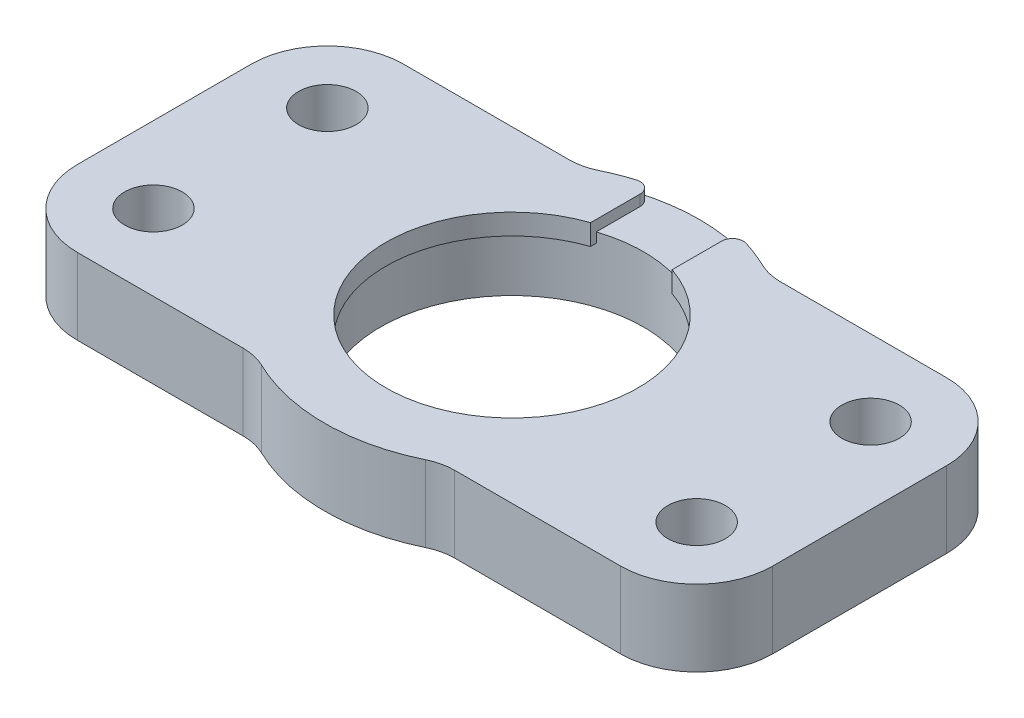
ISO-10303-21;
HEADER;
FILE_DESCRIPTION(('STEP AP214'),'2;1');
FILE_NAME('part.step','',(''),(''),'','','');
FILE_SCHEMA(('AUTOMOTIVE_DESIGN { 1 0 10303 214 1 1 1 1 }'));
ENDSEC;
DATA;
#1=APPLICATION_CONTEXT('core data for automotive mechanical design processes');
#2=APPLICATION_PROTOCOL_DEFINITION('international standard','automotive_design',2000,#1);
#3=PRODUCT_CONTEXT('',#1,'mechanical');
#4=PRODUCT('Part','Part','',(#3));
#5=PRODUCT_RELATED_PRODUCT_CATEGORY('part','',(#4));
#6=PRODUCT_DEFINITION_FORMATION('','',#4);
#7=PRODUCT_DEFINITION_CONTEXT('part definition',#1,'design');
#8=PRODUCT_DEFINITION('design','',#6,#7);
#9=PRODUCT_DEFINITION_SHAPE('','',#8);
#10=(LENGTH_UNIT() NAMED_UNIT(*) SI_UNIT(.MILLI.,.METRE.));
#11=(NAMED_UNIT(*) PLANE_ANGLE_UNIT() SI_UNIT($,.RADIAN.));
#12=(NAMED_UNIT(*) SI_UNIT($,.STERADIAN.) SOLID_ANGLE_UNIT());
#13=UNCERTAINTY_MEASURE_WITH_UNIT(LENGTH_MEASURE(1.E-05),#10,'distance_accuracy_value','');
#14=(GEOMETRIC_REPRESENTATION_CONTEXT(3) GLOBAL_UNCERTAINTY_ASSIGNED_CONTEXT((#13)) GLOBAL_UNIT_ASSIGNED_CONTEXT((#10,
#11,#12)) REPRESENTATION_CONTEXT('',''));
#15=CARTESIAN_POINT('',(0.,0.,0.));
#16=DIRECTION('',(0.,0.,1.));
#17=DIRECTION('',(1.,0.,0.));
#18=AXIS2_PLACEMENT_3D('',#15,#16,#17);
#19=CARTESIAN_POINT('',(24.985,7.,8.));
#20=DIRECTION('',(0.,-1.,0.));
#21=DIRECTION('',(0.,0.,-1.));
#22=AXIS2_PLACEMENT_3D('',#19,#20,#21);
#23=CYLINDRICAL_SURFACE('',#22,12.1);
#24=CARTESIAN_POINT('',(24.985,0.,8.));
#25=DIRECTION('',(0.,1.,0.));
#26=DIRECTION('',(0.,0.,1.));
#27=AXIS2_PLACEMENT_3D('',#24,#25,#26);
#28=CIRCLE('',#27,12.1);
#29=CARTESIAN_POINT('',(24.985,0.,20.1));
#30=VERTEX_POINT('',#29);
#31=EDGE_CURVE('E236',#30,#30,#28,.T.);
#32=ORIENTED_EDGE('',*,*,#31,.F.);
#33=EDGE_LOOP('',(#32));
#34=FACE_BOUND('',#33,.T.);
#35=DIRECTION('',(0.,1.,0.));
#36=VECTOR('',#35,1.);
#37=CARTESIAN_POINT('',(21.235,0.,-3.50423834940845));
#38=LINE('',#37,#36);
#39=CARTESIAN_POINT('',(21.235,5.1,-3.50423834940845));
#40=VERTEX_POINT('',#39);
#41=CARTESIAN_POINT('',(21.235,6.,-3.50423834940845));
#42=VERTEX_POINT('',#41);
#43=EDGE_CURVE('E205',#40,#42,#38,.T.);
#44=ORIENTED_EDGE('',*,*,#43,.F.);
#45=CARTESIAN_POINT('',(24.985,5.1,8.));
#46=DIRECTION('',(0.,1.,0.));
#47=DIRECTION('',(0.,0.,1.));
#48=AXIS2_PLACEMENT_3D('',#45,#46,#47);
#49=CIRCLE('',#48,12.1);
#50=CARTESIAN_POINT('',(28.735,5.1,-3.50423834940845));
#51=VERTEX_POINT('',#50);
#52=EDGE_CURVE('E202',#40,#51,#49,.T.);
#53=ORIENTED_EDGE('',*,*,#52,.T.);
#54=DIRECTION('',(0.,1.,0.));
#55=VECTOR('',#54,1.);
#56=CARTESIAN_POINT('',(28.735,0.,-3.50423834940845));
#57=LINE('',#56,#55);
#58=CARTESIAN_POINT('',(28.735,6.,-3.50423834940845));
#59=VERTEX_POINT('',#58);
#60=EDGE_CURVE('E197',#51,#59,#57,.T.);
#61=ORIENTED_EDGE('',*,*,#60,.T.);
#62=CARTESIAN_POINT('',(24.985,6.,8.));
#63=DIRECTION('',(0.,1.,0.));
#64=DIRECTION('',(0.,0.,1.));
#65=AXIS2_PLACEMENT_3D('',#62,#63,#64);
#66=CIRCLE('',#65,12.1);
#67=EDGE_CURVE('E200',#59,#42,#66,.T.);
#68=ORIENTED_EDGE('',*,*,#67,.T.);
#69=EDGE_LOOP('',(#44,#53,#61,#68));
#70=FACE_BOUND('',#69,.T.);
#71=ADVANCED_FACE('F35',(#34,#70),#23,.F.);
#72=CARTESIAN_POINT('',(24.985,7.,8.));
#73=DIRECTION('',(0.,1.,0.));
#74=DIRECTION('',(0.,0.,1.));
#75=AXIS2_PLACEMENT_3D('',#72,#73,#74);
#76=PLANE('',#75);
#77=DIRECTION('',(0.,0.,1.));
#78=VECTOR('',#77,1.);
#79=CARTESIAN_POINT('',(21.235,7.,-8.82721307881968));
#80=LINE('',#79,#78);
#81=CARTESIAN_POINT('',(21.235,7.,-7.52981326352639));
#82=VERTEX_POINT('',#81);
#83=CARTESIAN_POINT('',(21.235,7.,-2.97713532757978));
#84=VERTEX_POINT('',#83);
#85=EDGE_CURVE('E223',#82,#84,#80,.T.);
#86=ORIENTED_EDGE('',*,*,#85,.F.);
#87=CARTESIAN_POINT('',(20.235,7.,-7.52981326352639));
#88=DIRECTION('',(0.,1.,0.));
#89=DIRECTION('',(0.,0.,1.));
#90=AXIS2_PLACEMENT_3D('',#87,#88,#89);
#91=CIRCLE('',#90,1.);
#92=CARTESIAN_POINT('',(19.9425123152709,7.,-8.4860825531524));
#93=VERTEX_POINT('',#92);
#94=EDGE_CURVE('E386',#82,#93,#91,.T.);
#95=ORIENTED_EDGE('',*,*,#94,.T.);
#96=CARTESIAN_POINT('',(24.985,7.,8.));
#97=DIRECTION('',(0.,1.,0.));
#98=DIRECTION('',(0.,0.,1.));
#99=AXIS2_PLACEMENT_3D('',#96,#97,#98);
#100=CIRCLE('',#99,17.24);
#101=CARTESIAN_POINT('',(17.4447031710055,7.,-7.50359712230216));
#102=VERTEX_POINT('',#101);
#103=EDGE_CURVE('E279',#93,#102,#100,.T.);
#104=ORIENTED_EDGE('',*,*,#103,.T.);
#105=CARTESIAN_POINT('',(15.2578421417148,7.,-12.));
#106=DIRECTION('',(0.,1.,0.));
#107=DIRECTION('',(0.,0.,1.));
#108=AXIS2_PLACEMENT_3D('',#105,#106,#107);
#109=CIRCLE('',#108,5.);
#110=CARTESIAN_POINT('',(15.2578421417148,7.,-7.));
#111=VERTEX_POINT('',#110);
#112=EDGE_CURVE('E379',#102,#111,#109,.F.);
#113=ORIENTED_EDGE('',*,*,#112,.T.);
#114=DIRECTION('',(-1.,0.,0.));
#115=VECTOR('',#114,1.);
#116=CARTESIAN_POINT('',(0.,7.,-7.));
#117=LINE('',#116,#115);
#118=CARTESIAN_POINT('',(0.,7.,-7.));
#119=VERTEX_POINT('',#118);
#120=EDGE_CURVE('E283',#111,#119,#117,.T.);
#121=ORIENTED_EDGE('',*,*,#120,.T.);
#122=CARTESIAN_POINT('',(0.,7.,0.));
#123=DIRECTION('',(0.,1.,0.));
#124=DIRECTION('',(0.,0.,-1.));
#125=AXIS2_PLACEMENT_3D('',#122,#123,#124);
#126=CIRCLE('',#125,7.);
#127=CARTESIAN_POINT('',(-7.,7.,0.));
#128=VERTEX_POINT('',#127);
#129=EDGE_CURVE('E285',#119,#128,#126,.T.);
#130=ORIENTED_EDGE('',*,*,#129,.T.);
#131=DIRECTION('',(0.,0.,1.));
#132=VECTOR('',#131,1.);
#133=CARTESIAN_POINT('',(-7.,7.,0.));
#134=LINE('',#133,#132);
#135=CARTESIAN_POINT('',(-7.,7.,16.));
#136=VERTEX_POINT('',#135);
#137=EDGE_CURVE('E287',#128,#136,#134,.T.);
#138=ORIENTED_EDGE('',*,*,#137,.T.);
#139=CARTESIAN_POINT('',(0.,7.,16.));
#140=DIRECTION('',(0.,1.,0.));
#141=DIRECTION('',(0.,0.,-1.));
#142=AXIS2_PLACEMENT_3D('',#139,#140,#141);
#143=CIRCLE('',#142,7.);
#144=CARTESIAN_POINT('',(0.,7.,23.));
#145=VERTEX_POINT('',#144);
#146=EDGE_CURVE('E289',#136,#145,#143,.T.);
#147=ORIENTED_EDGE('',*,*,#146,.T.);
#148=DIRECTION('',(1.,0.,0.));
#149=VECTOR('',#148,1.);
#150=CARTESIAN_POINT('',(0.,7.,23.));
#151=LINE('',#150,#149);
#152=CARTESIAN_POINT('',(15.2578421417148,7.,23.));
#153=VERTEX_POINT('',#152);
#154=EDGE_CURVE('E291',#145,#153,#151,.T.);
#155=ORIENTED_EDGE('',*,*,#154,.T.);
#156=CARTESIAN_POINT('',(15.2578421417148,7.,28.));
#157=DIRECTION('',(0.,1.,0.));
#158=DIRECTION('',(0.,0.,1.));
#159=AXIS2_PLACEMENT_3D('',#156,#157,#158);
#160=CIRCLE('',#159,5.);
#161=CARTESIAN_POINT('',(17.4447031710055,7.,23.5035971223022));
#162=VERTEX_POINT('',#161);
#163=EDGE_CURVE('E371',#153,#162,#160,.F.);
#164=ORIENTED_EDGE('',*,*,#163,.T.);
#165=CARTESIAN_POINT('',(24.985,7.,8.));
#166=DIRECTION('',(0.,1.,0.));
#167=DIRECTION('',(0.,0.,1.));
#168=AXIS2_PLACEMENT_3D('',#165,#166,#167);
#169=CIRCLE('',#168,17.24);
#170=CARTESIAN_POINT('',(32.5252968289945,7.,23.5035971223022));
#171=VERTEX_POINT('',#170);
#172=EDGE_CURVE('E264',#162,#171,#169,.T.);
#173=ORIENTED_EDGE('',*,*,#172,.T.);
#174=CARTESIAN_POINT('',(34.7121578582852,7.,28.));
#175=DIRECTION('',(0.,1.,0.));
#176=DIRECTION('',(0.,0.,1.));
#177=AXIS2_PLACEMENT_3D('',#174,#175,#176);
#178=CIRCLE('',#177,5.);
#179=CARTESIAN_POINT('',(34.7121578582852,7.,23.));
#180=VERTEX_POINT('',#179);
#181=EDGE_CURVE('E367',#171,#180,#178,.F.);
#182=ORIENTED_EDGE('',*,*,#181,.T.);
#183=DIRECTION('',(1.,0.,0.));
#184=VECTOR('',#183,1.);
#185=CARTESIAN_POINT('',(33.4830939039293,7.,23.));
#186=LINE('',#185,#184);
#187=CARTESIAN_POINT('',(49.97,7.,23.));
#188=VERTEX_POINT('',#187);
#189=EDGE_CURVE('E267',#180,#188,#186,.T.);
#190=ORIENTED_EDGE('',*,*,#189,.T.);
#191=CARTESIAN_POINT('',(49.97,7.,16.));
#192=DIRECTION('',(0.,1.,0.));
#193=DIRECTION('',(0.,0.,1.));
#194=AXIS2_PLACEMENT_3D('',#191,#192,#193);
#195=CIRCLE('',#194,7.);
#196=CARTESIAN_POINT('',(56.97,7.,16.));
#197=VERTEX_POINT('',#196);
#198=EDGE_CURVE('E270',#188,#197,#195,.T.);
#199=ORIENTED_EDGE('',*,*,#198,.T.);
#200=DIRECTION('',(0.,0.,-1.));
#201=VECTOR('',#200,1.);
#202=CARTESIAN_POINT('',(56.97,7.,0.));
#203=LINE('',#202,#201);
#204=CARTESIAN_POINT('',(56.97,7.,0.));
#205=VERTEX_POINT('',#204);
#206=EDGE_CURVE('E272',#197,#205,#203,.T.);
#207=ORIENTED_EDGE('',*,*,#206,.T.);
#208=CARTESIAN_POINT('',(49.97,7.,0.));
#209=DIRECTION('',(0.,1.,0.));
#210=DIRECTION('',(0.,0.,1.));
#211=AXIS2_PLACEMENT_3D('',#208,#209,#210);
#212=CIRCLE('',#211,7.);
#213=CARTESIAN_POINT('',(49.97,7.,-7.));
#214=VERTEX_POINT('',#213);
#215=EDGE_CURVE('E274',#205,#214,#212,.T.);
#216=ORIENTED_EDGE('',*,*,#215,.T.);
#217=DIRECTION('',(-1.,0.,0.));
#218=VECTOR('',#217,1.);
#219=CARTESIAN_POINT('',(33.4830939039293,7.,-7.));
#220=LINE('',#219,#218);
#221=CARTESIAN_POINT('',(34.7121578582852,7.,-7.));
#222=VERTEX_POINT('',#221);
#223=EDGE_CURVE('E276',#214,#222,#220,.T.);
#224=ORIENTED_EDGE('',*,*,#223,.T.);
#225=CARTESIAN_POINT('',(34.7121578582852,7.,-12.));
#226=DIRECTION('',(0.,1.,0.));
#227=DIRECTION('',(0.,0.,1.));
#228=AXIS2_PLACEMENT_3D('',#225,#226,#227);
#229=CIRCLE('',#228,5.);
#230=CARTESIAN_POINT('',(32.5252968289945,7.,-7.50359712230216));
#231=VERTEX_POINT('',#230);
#232=EDGE_CURVE('E375',#222,#231,#229,.F.);
#233=ORIENTED_EDGE('',*,*,#232,.T.);
#234=CARTESIAN_POINT('',(30.0274876847291,7.,-8.4860825531524));
#235=VERTEX_POINT('',#234);
#236=EDGE_CURVE('E280',#231,#235,#100,.T.);
#237=ORIENTED_EDGE('',*,*,#236,.T.);
#238=CARTESIAN_POINT('',(29.735,7.,-7.52981326352639));
#239=DIRECTION('',(0.,1.,0.));
#240=DIRECTION('',(0.,0.,1.));
#241=AXIS2_PLACEMENT_3D('',#238,#239,#240);
#242=CIRCLE('',#241,1.);
#243=CARTESIAN_POINT('',(28.735,7.,-7.52981326352639));
#244=VERTEX_POINT('',#243);
#245=EDGE_CURVE('E384',#235,#244,#242,.T.);
#246=ORIENTED_EDGE('',*,*,#245,.T.);
#247=DIRECTION('',(0.,0.,-1.));
#248=VECTOR('',#247,1.);
#249=CARTESIAN_POINT('',(28.735,7.,-8.82721307881968));
#250=LINE('',#249,#248);
#251=CARTESIAN_POINT('',(28.735,7.,-2.97713532757978));
#252=VERTEX_POINT('',#251);
#253=EDGE_CURVE('E225',#252,#244,#250,.T.);
#254=ORIENTED_EDGE('',*,*,#253,.F.);
#255=CARTESIAN_POINT('',(24.985,7.,8.));
#256=DIRECTION('',(0.,1.,0.));
#257=DIRECTION('',(0.,0.,1.));
#258=AXIS2_PLACEMENT_3D('',#255,#256,#257);
#259=CIRCLE('',#258,11.6);
#260=EDGE_CURVE('E228',#84,#252,#259,.T.);
#261=ORIENTED_EDGE('',*,*,#260,.F.);
#262=EDGE_LOOP('',(#86,#95,#104,#113,#121,#130,#138,#147,#155,#164,#173,#182,#190,#199,#207,
#216,#224,#233,#237,#246,#254,#261));
#263=FACE_BOUND('',#262,.T.);
#264=CARTESIAN_POINT('',(49.97,7.,16.));
#265=DIRECTION('',(0.,1.,0.));
#266=DIRECTION('',(0.,0.,-1.));
#267=AXIS2_PLACEMENT_3D('',#264,#265,#266);
#268=CIRCLE('',#267,2.65);
#269=CARTESIAN_POINT('',(49.97,7.,13.35));
#270=VERTEX_POINT('',#269);
#271=EDGE_CURVE('E240',#270,#270,#268,.T.);
#272=ORIENTED_EDGE('',*,*,#271,.F.);
#273=EDGE_LOOP('',(#272));
#274=FACE_BOUND('',#273,.T.);
#275=CARTESIAN_POINT('',(0.,7.,16.));
#276=DIRECTION('',(0.,1.,0.));
#277=DIRECTION('',(0.,0.,1.));
#278=AXIS2_PLACEMENT_3D('',#275,#276,#277);
#279=CIRCLE('',#278,2.65);
#280=CARTESIAN_POINT('',(0.,7.,18.65));
#281=VERTEX_POINT('',#280);
#282=EDGE_CURVE('E252',#281,#281,#279,.T.);
#283=ORIENTED_EDGE('',*,*,#282,.F.);
#284=EDGE_LOOP('',(#283));
#285=FACE_BOUND('',#284,.T.);
#286=CARTESIAN_POINT('',(0.,7.,0.));
#287=DIRECTION('',(0.,1.,0.));
#288=DIRECTION('',(0.,0.,1.));
#289=AXIS2_PLACEMENT_3D('',#286,#287,#288);
#290=CIRCLE('',#289,2.65);
#291=CARTESIAN_POINT('',(0.,7.,2.65));
#292=VERTEX_POINT('',#291);
#293=EDGE_CURVE('E258',#292,#292,#290,.T.);
#294=ORIENTED_EDGE('',*,*,#293,.F.);
#295=EDGE_LOOP('',(#294));
#296=FACE_BOUND('',#295,.T.);
#297=CARTESIAN_POINT('',(49.97,7.,0.));
#298=DIRECTION('',(0.,1.,0.));
#299=DIRECTION('',(0.,0.,1.));
#300=AXIS2_PLACEMENT_3D('',#297,#298,#299);
#301=CIRCLE('',#300,2.65);
#302=CARTESIAN_POINT('',(49.97,7.,2.65));
#303=VERTEX_POINT('',#302);
#304=EDGE_CURVE('E246',#303,#303,#301,.T.);
#305=ORIENTED_EDGE('',*,*,#304,.F.);
#306=EDGE_LOOP('',(#305));
#307=FACE_BOUND('',#306,.T.);
#308=ADVANCED_FACE('F403',(#263,#274,#285,#296,#307),#76,.T.);
#309=CARTESIAN_POINT('',(24.985,0.,8.));
#310=DIRECTION('',(0.,1.,0.));
#311=DIRECTION('',(0.,0.,1.));
#312=AXIS2_PLACEMENT_3D('',#309,#310,#311);
#313=PLANE('',#312);
#314=CARTESIAN_POINT('',(24.985,0.,8.));
#315=DIRECTION('',(0.,1.,0.));
#316=DIRECTION('',(0.,0.,1.));
#317=AXIS2_PLACEMENT_3D('',#314,#315,#316);
#318=CIRCLE('',#317,17.24);
#319=CARTESIAN_POINT('',(17.4447031710055,0.,23.5035971223022));
#320=VERTEX_POINT('',#319);
#321=CARTESIAN_POINT('',(32.5252968289945,0.,23.5035971223022));
#322=VERTEX_POINT('',#321);
#323=EDGE_CURVE('E261',#320,#322,#318,.T.);
#324=ORIENTED_EDGE('',*,*,#323,.F.);
#325=CARTESIAN_POINT('',(15.2578421417148,0.,28.));
#326=DIRECTION('',(0.,1.,0.));
#327=DIRECTION('',(0.,0.,1.));
#328=AXIS2_PLACEMENT_3D('',#325,#326,#327);
#329=CIRCLE('',#328,5.);
#330=CARTESIAN_POINT('',(15.2578421417148,0.,23.));
#331=VERTEX_POINT('',#330);
#332=EDGE_CURVE('E369',#320,#331,#329,.T.);
#333=ORIENTED_EDGE('',*,*,#332,.T.);
#334=DIRECTION('',(1.,0.,0.));
#335=VECTOR('',#334,1.);
#336=CARTESIAN_POINT('',(0.,0.,23.));
#337=LINE('',#336,#335);
#338=CARTESIAN_POINT('',(0.,0.,23.));
#339=VERTEX_POINT('',#338);
#340=EDGE_CURVE('E268',#339,#331,#337,.T.);
#341=ORIENTED_EDGE('',*,*,#340,.F.);
#342=CARTESIAN_POINT('',(0.,0.,16.));
#343=DIRECTION('',(0.,1.,0.));
#344=DIRECTION('',(0.,0.,-1.));
#345=AXIS2_PLACEMENT_3D('',#342,#343,#344);
#346=CIRCLE('',#345,7.);
#347=CARTESIAN_POINT('',(-7.,0.,16.));
#348=VERTEX_POINT('',#347);
#349=EDGE_CURVE('E317',#348,#339,#346,.T.);
#350=ORIENTED_EDGE('',*,*,#349,.F.);
#351=DIRECTION('',(0.,0.,1.));
#352=VECTOR('',#351,1.);
#353=CARTESIAN_POINT('',(-7.,0.,0.));
#354=LINE('',#353,#352);
#355=CARTESIAN_POINT('',(-7.,0.,0.));
#356=VERTEX_POINT('',#355);
#357=EDGE_CURVE('E315',#356,#348,#354,.T.);
#358=ORIENTED_EDGE('',*,*,#357,.F.);
#359=CARTESIAN_POINT('',(0.,0.,0.));
#360=DIRECTION('',(0.,1.,0.));
#361=DIRECTION('',(0.,0.,-1.));
#362=AXIS2_PLACEMENT_3D('',#359,#360,#361);
#363=CIRCLE('',#362,7.);
#364=CARTESIAN_POINT('',(0.,0.,-7.));
#365=VERTEX_POINT('',#364);
#366=EDGE_CURVE('E313',#365,#356,#363,.T.);
#367=ORIENTED_EDGE('',*,*,#366,.F.);
#368=DIRECTION('',(-1.,0.,0.));
#369=VECTOR('',#368,1.);
#370=CARTESIAN_POINT('',(0.,0.,-7.));
#371=LINE('',#370,#369);
#372=CARTESIAN_POINT('',(15.2578421417148,0.,-7.));
#373=VERTEX_POINT('',#372);
#374=EDGE_CURVE('E311',#373,#365,#371,.T.);
#375=ORIENTED_EDGE('',*,*,#374,.F.);
#376=CARTESIAN_POINT('',(15.2578421417148,0.,-12.));
#377=DIRECTION('',(0.,1.,0.));
#378=DIRECTION('',(0.,0.,1.));
#379=AXIS2_PLACEMENT_3D('',#376,#377,#378);
#380=CIRCLE('',#379,5.);
#381=CARTESIAN_POINT('',(17.4447031710055,0.,-7.50359712230216));
#382=VERTEX_POINT('',#381);
#383=EDGE_CURVE('E377',#373,#382,#380,.T.);
#384=ORIENTED_EDGE('',*,*,#383,.T.);
#385=CARTESIAN_POINT('',(24.985,0.,8.));
#386=DIRECTION('',(0.,1.,0.));
#387=DIRECTION('',(0.,0.,1.));
#388=AXIS2_PLACEMENT_3D('',#385,#386,#387);
#389=CIRCLE('',#388,17.24);
#390=CARTESIAN_POINT('',(32.5252968289945,0.,-7.50359712230216));
#391=VERTEX_POINT('',#390);
#392=EDGE_CURVE('E308',#391,#382,#389,.T.);
#393=ORIENTED_EDGE('',*,*,#392,.F.);
#394=CARTESIAN_POINT('',(34.7121578582852,0.,-12.));
#395=DIRECTION('',(0.,1.,0.));
#396=DIRECTION('',(0.,0.,1.));
#397=AXIS2_PLACEMENT_3D('',#394,#395,#396);
#398=CIRCLE('',#397,5.);
#399=CARTESIAN_POINT('',(34.7121578582852,0.,-7.));
#400=VERTEX_POINT('',#399);
#401=EDGE_CURVE('E373',#391,#400,#398,.T.);
#402=ORIENTED_EDGE('',*,*,#401,.T.);
#403=DIRECTION('',(-1.,0.,0.));
#404=VECTOR('',#403,1.);
#405=CARTESIAN_POINT('',(33.4830939039293,0.,-7.));
#406=LINE('',#405,#404);
#407=CARTESIAN_POINT('',(49.97,0.,-7.));
#408=VERTEX_POINT('',#407);
#409=EDGE_CURVE('E305',#408,#400,#406,.T.);
#410=ORIENTED_EDGE('',*,*,#409,.F.);
#411=CARTESIAN_POINT('',(49.97,0.,0.));
#412=DIRECTION('',(0.,1.,0.));
#413=DIRECTION('',(0.,0.,1.));
#414=AXIS2_PLACEMENT_3D('',#411,#412,#413);
#415=CIRCLE('',#414,7.);
#416=CARTESIAN_POINT('',(56.97,0.,0.));
#417=VERTEX_POINT('',#416);
#418=EDGE_CURVE('E303',#417,#408,#415,.T.);
#419=ORIENTED_EDGE('',*,*,#418,.F.);
#420=DIRECTION('',(0.,0.,-1.));
#421=VECTOR('',#420,1.);
#422=CARTESIAN_POINT('',(56.97,0.,0.));
#423=LINE('',#422,#421);
#424=CARTESIAN_POINT('',(56.97,0.,16.));
#425=VERTEX_POINT('',#424);
#426=EDGE_CURVE('E301',#425,#417,#423,.T.);
#427=ORIENTED_EDGE('',*,*,#426,.F.);
#428=CARTESIAN_POINT('',(49.97,0.,16.));
#429=DIRECTION('',(0.,1.,0.));
#430=DIRECTION('',(0.,0.,1.));
#431=AXIS2_PLACEMENT_3D('',#428,#429,#430);
#432=CIRCLE('',#431,7.);
#433=CARTESIAN_POINT('',(49.97,0.,23.));
#434=VERTEX_POINT('',#433);
#435=EDGE_CURVE('E299',#434,#425,#432,.T.);
#436=ORIENTED_EDGE('',*,*,#435,.F.);
#437=DIRECTION('',(1.,0.,0.));
#438=VECTOR('',#437,1.);
#439=CARTESIAN_POINT('',(33.4830939039293,0.,23.));
#440=LINE('',#439,#438);
#441=CARTESIAN_POINT('',(34.7121578582852,0.,23.));
#442=VERTEX_POINT('',#441);
#443=EDGE_CURVE('E297',#442,#434,#440,.T.);
#444=ORIENTED_EDGE('',*,*,#443,.F.);
#445=CARTESIAN_POINT('',(34.7121578582852,0.,28.));
#446=DIRECTION('',(0.,1.,0.));
#447=DIRECTION('',(0.,0.,1.));
#448=AXIS2_PLACEMENT_3D('',#445,#446,#447);
#449=CIRCLE('',#448,5.);
#450=EDGE_CURVE('E365',#442,#322,#449,.T.);
#451=ORIENTED_EDGE('',*,*,#450,.T.);
#452=EDGE_LOOP('',(#324,#333,#341,#350,#358,#367,#375,#384,#393,#402,#410,#419,#427,#436,#444,#451));
#453=FACE_BOUND('',#452,.T.);
#454=CARTESIAN_POINT('',(0.,0.,0.));
#455=DIRECTION('',(0.,1.,0.));
#456=DIRECTION('',(0.,0.,1.));
#457=AXIS2_PLACEMENT_3D('',#454,#455,#456);
#458=CIRCLE('',#457,2.65);
#459=CARTESIAN_POINT('',(0.,0.,2.65));
#460=VERTEX_POINT('',#459);
#461=EDGE_CURVE('E255',#460,#460,#458,.T.);
#462=ORIENTED_EDGE('',*,*,#461,.T.);
#463=EDGE_LOOP('',(#462));
#464=FACE_BOUND('',#463,.T.);
#465=CARTESIAN_POINT('',(0.,0.,16.));
#466=DIRECTION('',(0.,1.,0.));
#467=DIRECTION('',(0.,0.,1.));
#468=AXIS2_PLACEMENT_3D('',#465,#466,#467);
#469=CIRCLE('',#468,2.65);
#470=CARTESIAN_POINT('',(0.,0.,18.65));
#471=VERTEX_POINT('',#470);
#472=EDGE_CURVE('E249',#471,#471,#469,.T.);
#473=ORIENTED_EDGE('',*,*,#472,.T.);
#474=EDGE_LOOP('',(#473));
#475=FACE_BOUND('',#474,.T.);
#476=CARTESIAN_POINT('',(49.97,0.,0.));
#477=DIRECTION('',(0.,1.,0.));
#478=DIRECTION('',(0.,0.,1.));
#479=AXIS2_PLACEMENT_3D('',#476,#477,#478);
#480=CIRCLE('',#479,2.65);
#481=CARTESIAN_POINT('',(49.97,0.,2.65));
#482=VERTEX_POINT('',#481);
#483=EDGE_CURVE('E243',#482,#482,#480,.T.);
#484=ORIENTED_EDGE('',*,*,#483,.T.);
#485=EDGE_LOOP('',(#484));
#486=FACE_BOUND('',#485,.T.);
#487=CARTESIAN_POINT('',(49.97,0.,16.));
#488=DIRECTION('',(0.,1.,0.));
#489=DIRECTION('',(0.,0.,-1.));
#490=AXIS2_PLACEMENT_3D('',#487,#488,#489);
#491=CIRCLE('',#490,2.65);
#492=CARTESIAN_POINT('',(49.97,0.,13.35));
#493=VERTEX_POINT('',#492);
#494=EDGE_CURVE('E239',#493,#493,#491,.T.);
#495=ORIENTED_EDGE('',*,*,#494,.T.);
#496=EDGE_LOOP('',(#495));
#497=FACE_BOUND('',#496,.T.);
#498=ORIENTED_EDGE('',*,*,#31,.T.);
#499=EDGE_LOOP('',(#498));
#500=FACE_BOUND('',#499,.T.);
#501=ADVANCED_FACE('F449',(#453,#464,#475,#486,#497,#500),#313,.F.);
#502=CARTESIAN_POINT('',(24.985,7.,8.));
#503=DIRECTION('',(0.,-1.,0.));
#504=DIRECTION('',(0.,0.,-1.));
#505=AXIS2_PLACEMENT_3D('',#502,#503,#504);
#506=CYLINDRICAL_SURFACE('',#505,17.24);
#507=ORIENTED_EDGE('',*,*,#323,.T.);
#508=DIRECTION('',(0.,-1.,0.));
#509=VECTOR('',#508,1.);
#510=CARTESIAN_POINT('',(32.5252968289945,7.,23.5035971223022));
#511=LINE('',#510,#509);
#512=EDGE_CURVE('E350',#322,#171,#511,.F.);
#513=ORIENTED_EDGE('',*,*,#512,.T.);
#514=ORIENTED_EDGE('',*,*,#172,.F.);
#515=DIRECTION('',(0.,-1.,0.));
#516=VECTOR('',#515,1.);
#517=CARTESIAN_POINT('',(17.4447031710055,7.,23.5035971223022));
#518=LINE('',#517,#516);
#519=EDGE_CURVE('E347',#162,#320,#518,.T.);
#520=ORIENTED_EDGE('',*,*,#519,.T.);
#521=EDGE_LOOP('',(#507,#513,#514,#520));
#522=FACE_BOUND('',#521,.T.);
#523=ADVANCED_FACE('F446',(#522),#506,.T.);
#524=CARTESIAN_POINT('',(33.4830939039293,7.,23.));
#525=DIRECTION('',(0.,0.,-1.));
#526=DIRECTION('',(-1.,0.,0.));
#527=AXIS2_PLACEMENT_3D('',#524,#525,#526);
#528=PLANE('',#527);
#529=ORIENTED_EDGE('',*,*,#189,.F.);
#530=DIRECTION('',(0.,1.,0.));
#531=VECTOR('',#530,1.);
#532=CARTESIAN_POINT('',(34.7121578582852,0.,23.));
#533=LINE('',#532,#531);
#534=EDGE_CURVE('E344',#180,#442,#533,.F.);
#535=ORIENTED_EDGE('',*,*,#534,.T.);
#536=ORIENTED_EDGE('',*,*,#443,.T.);
#537=DIRECTION('',(0.,-1.,0.));
#538=VECTOR('',#537,1.);
#539=CARTESIAN_POINT('',(49.97,7.,23.));
#540=LINE('',#539,#538);
#541=EDGE_CURVE('E341',#188,#434,#540,.T.);
#542=ORIENTED_EDGE('',*,*,#541,.F.);
#543=EDGE_LOOP('',(#529,#535,#536,#542));
#544=FACE_BOUND('',#543,.T.);
#545=ADVANCED_FACE('F459',(#544),#528,.F.);
#546=CARTESIAN_POINT('',(49.97,7.,16.));
#547=DIRECTION('',(0.,-1.,0.));
#548=DIRECTION('',(0.,0.,-1.));
#549=AXIS2_PLACEMENT_3D('',#546,#547,#548);
#550=CYLINDRICAL_SURFACE('',#549,7.);
#551=ORIENTED_EDGE('',*,*,#435,.T.);
#552=DIRECTION('',(0.,-1.,0.));
#553=VECTOR('',#552,1.);
#554=CARTESIAN_POINT('',(56.97,7.,16.));
#555=LINE('',#554,#553);
#556=EDGE_CURVE('E338',#197,#425,#555,.T.);
#557=ORIENTED_EDGE('',*,*,#556,.F.);
#558=ORIENTED_EDGE('',*,*,#198,.F.);
#559=ORIENTED_EDGE('',*,*,#541,.T.);
#560=EDGE_LOOP('',(#551,#557,#558,#559));
#561=FACE_BOUND('',#560,.T.);
#562=ADVANCED_FACE('F466',(#561),#550,.T.);
#563=CARTESIAN_POINT('',(56.97,7.,0.));
#564=DIRECTION('',(-1.,0.,0.));
#565=DIRECTION('',(0.,0.,1.));
#566=AXIS2_PLACEMENT_3D('',#563,#564,#565);
#567=PLANE('',#566);
#568=ORIENTED_EDGE('',*,*,#426,.T.);
#569=DIRECTION('',(0.,-1.,0.));
#570=VECTOR('',#569,1.);
#571=CARTESIAN_POINT('',(56.97,7.,0.));
#572=LINE('',#571,#570);
#573=EDGE_CURVE('E335',#205,#417,#572,.T.);
#574=ORIENTED_EDGE('',*,*,#573,.F.);
#575=ORIENTED_EDGE('',*,*,#206,.F.);
#576=ORIENTED_EDGE('',*,*,#556,.T.);
#577=EDGE_LOOP('',(#568,#574,#575,#576));
#578=FACE_BOUND('',#577,.T.);
#579=ADVANCED_FACE('F469',(#578),#567,.F.);
#580=CARTESIAN_POINT('',(49.97,7.,0.));
#581=DIRECTION('',(0.,-1.,0.));
#582=DIRECTION('',(0.,0.,-1.));
#583=AXIS2_PLACEMENT_3D('',#580,#581,#582);
#584=CYLINDRICAL_SURFACE('',#583,7.);
#585=ORIENTED_EDGE('',*,*,#418,.T.);
#586=DIRECTION('',(0.,-1.,0.));
#587=VECTOR('',#586,1.);
#588=CARTESIAN_POINT('',(49.97,7.,-7.));
#589=LINE('',#588,#587);
#590=EDGE_CURVE('E332',#214,#408,#589,.T.);
#591=ORIENTED_EDGE('',*,*,#590,.F.);
#592=ORIENTED_EDGE('',*,*,#215,.F.);
#593=ORIENTED_EDGE('',*,*,#573,.T.);
#594=EDGE_LOOP('',(#585,#591,#592,#593));
#595=FACE_BOUND('',#594,.T.);
#596=ADVANCED_FACE('F474',(#595),#584,.T.);
#597=CARTESIAN_POINT('',(33.4830939039293,7.,-7.));
#598=DIRECTION('',(0.,0.,1.));
#599=DIRECTION('',(1.,0.,0.));
#600=AXIS2_PLACEMENT_3D('',#597,#598,#599);
#601=PLANE('',#600);
#602=ORIENTED_EDGE('',*,*,#409,.T.);
#603=DIRECTION('',(0.,1.,0.));
#604=VECTOR('',#603,1.);
#605=CARTESIAN_POINT('',(34.7121578582852,7.,-7.));
#606=LINE('',#605,#604);
#607=EDGE_CURVE('E360',#400,#222,#606,.T.);
#608=ORIENTED_EDGE('',*,*,#607,.T.);
#609=ORIENTED_EDGE('',*,*,#223,.F.);
#610=ORIENTED_EDGE('',*,*,#590,.T.);
#611=EDGE_LOOP('',(#602,#608,#609,#610));
#612=FACE_BOUND('',#611,.T.);
#613=ADVANCED_FACE('F484',(#612),#601,.F.);
#614=CARTESIAN_POINT('',(24.985,7.,8.));
#615=DIRECTION('',(0.,-1.,0.));
#616=DIRECTION('',(0.,0.,-1.));
#617=AXIS2_PLACEMENT_3D('',#614,#615,#616);
#618=CYLINDRICAL_SURFACE('',#617,17.24);
#619=ORIENTED_EDGE('',*,*,#103,.F.);
#620=DIRECTION('',(0.,-1.,0.));
#621=VECTOR('',#620,1.);
#622=CARTESIAN_POINT('',(19.9425123152709,7.,-8.4860825531524));
#623=LINE('',#622,#621);
#624=CARTESIAN_POINT('',(19.9425123152709,6.,-8.4860825531524));
#625=VERTEX_POINT('',#624);
#626=EDGE_CURVE('E391',#93,#625,#623,.T.);
#627=ORIENTED_EDGE('',*,*,#626,.T.);
#628=CARTESIAN_POINT('',(24.985,6.,8.));
#629=DIRECTION('',(0.,1.,0.));
#630=DIRECTION('',(0.,0.,1.));
#631=AXIS2_PLACEMENT_3D('',#628,#629,#630);
#632=CIRCLE('',#631,17.24);
#633=CARTESIAN_POINT('',(30.0274876847291,6.,-8.4860825531524));
#634=VERTEX_POINT('',#633);
#635=EDGE_CURVE('E57',#634,#625,#632,.T.);
#636=ORIENTED_EDGE('',*,*,#635,.F.);
#637=DIRECTION('',(0.,-1.,0.));
#638=VECTOR('',#637,1.);
#639=CARTESIAN_POINT('',(30.0274876847291,7.,-8.4860825531524));
#640=LINE('',#639,#638);
#641=EDGE_CURVE('E388',#634,#235,#640,.F.);
#642=ORIENTED_EDGE('',*,*,#641,.T.);
#643=ORIENTED_EDGE('',*,*,#236,.F.);
#644=DIRECTION('',(0.,-1.,0.));
#645=VECTOR('',#644,1.);
#646=CARTESIAN_POINT('',(32.5252968289945,7.,-7.50359712230216));
#647=LINE('',#646,#645);
#648=EDGE_CURVE('E357',#231,#391,#647,.T.);
#649=ORIENTED_EDGE('',*,*,#648,.T.);
#650=ORIENTED_EDGE('',*,*,#392,.T.);
#651=DIRECTION('',(0.,-1.,0.));
#652=VECTOR('',#651,1.);
#653=CARTESIAN_POINT('',(17.4447031710055,7.,-7.50359712230216));
#654=LINE('',#653,#652);
#655=EDGE_CURVE('E354',#382,#102,#654,.F.);
#656=ORIENTED_EDGE('',*,*,#655,.T.);
#657=EDGE_LOOP('',(#619,#627,#636,#642,#643,#649,#650,#656));
#658=FACE_BOUND('',#657,.T.);
#659=ADVANCED_FACE('F407',(#658),#618,.T.);
#660=CARTESIAN_POINT('',(0.,7.,-7.));
#661=DIRECTION('',(0.,0.,1.));
#662=DIRECTION('',(1.,0.,0.));
#663=AXIS2_PLACEMENT_3D('',#660,#661,#662);
#664=PLANE('',#663);
#665=ORIENTED_EDGE('',*,*,#120,.F.);
#666=DIRECTION('',(0.,1.,0.));
#667=VECTOR('',#666,1.);
#668=CARTESIAN_POINT('',(15.2578421417148,0.,-7.));
#669=LINE('',#668,#667);
#670=EDGE_CURVE('E362',#111,#373,#669,.F.);
#671=ORIENTED_EDGE('',*,*,#670,.T.);
#672=ORIENTED_EDGE('',*,*,#374,.T.);
#673=DIRECTION('',(0.,-1.,0.));
#674=VECTOR('',#673,1.);
#675=CARTESIAN_POINT('',(0.,7.,-7.));
#676=LINE('',#675,#674);
#677=EDGE_CURVE('E329',#119,#365,#676,.T.);
#678=ORIENTED_EDGE('',*,*,#677,.F.);
#679=EDGE_LOOP('',(#665,#671,#672,#678));
#680=FACE_BOUND('',#679,.T.);
#681=ADVANCED_FACE('F417',(#680),#664,.F.);
#682=CARTESIAN_POINT('',(0.,7.,0.));
#683=DIRECTION('',(0.,-1.,0.));
#684=DIRECTION('',(0.,0.,-1.));
#685=AXIS2_PLACEMENT_3D('',#682,#683,#684);
#686=CYLINDRICAL_SURFACE('',#685,7.);
#687=ORIENTED_EDGE('',*,*,#366,.T.);
#688=DIRECTION('',(0.,-1.,0.));
#689=VECTOR('',#688,1.);
#690=CARTESIAN_POINT('',(-7.,7.,0.));
#691=LINE('',#690,#689);
#692=EDGE_CURVE('E326',#128,#356,#691,.T.);
#693=ORIENTED_EDGE('',*,*,#692,.F.);
#694=ORIENTED_EDGE('',*,*,#129,.F.);
#695=ORIENTED_EDGE('',*,*,#677,.T.);
#696=EDGE_LOOP('',(#687,#693,#694,#695));
#697=FACE_BOUND('',#696,.T.);
#698=ADVANCED_FACE('F423',(#697),#686,.T.);
#699=CARTESIAN_POINT('',(-7.,7.,0.));
#700=DIRECTION('',(1.,0.,0.));
#701=DIRECTION('',(0.,0.,-1.));
#702=AXIS2_PLACEMENT_3D('',#699,#700,#701);
#703=PLANE('',#702);
#704=ORIENTED_EDGE('',*,*,#357,.T.);
#705=DIRECTION('',(0.,-1.,0.));
#706=VECTOR('',#705,1.);
#707=CARTESIAN_POINT('',(-7.,7.,16.));
#708=LINE('',#707,#706);
#709=EDGE_CURVE('E323',#136,#348,#708,.T.);
#710=ORIENTED_EDGE('',*,*,#709,.F.);
#711=ORIENTED_EDGE('',*,*,#137,.F.);
#712=ORIENTED_EDGE('',*,*,#692,.T.);
#713=EDGE_LOOP('',(#704,#710,#711,#712));
#714=FACE_BOUND('',#713,.T.);
#715=ADVANCED_FACE('F429',(#714),#703,.F.);
#716=CARTESIAN_POINT('',(0.,7.,16.));
#717=DIRECTION('',(0.,-1.,0.));
#718=DIRECTION('',(0.,0.,-1.));
#719=AXIS2_PLACEMENT_3D('',#716,#717,#718);
#720=CYLINDRICAL_SURFACE('',#719,7.);
#721=ORIENTED_EDGE('',*,*,#349,.T.);
#722=DIRECTION('',(0.,-1.,0.));
#723=VECTOR('',#722,1.);
#724=CARTESIAN_POINT('',(0.,7.,23.));
#725=LINE('',#724,#723);
#726=EDGE_CURVE('E294',#145,#339,#725,.T.);
#727=ORIENTED_EDGE('',*,*,#726,.F.);
#728=ORIENTED_EDGE('',*,*,#146,.F.);
#729=ORIENTED_EDGE('',*,*,#709,.T.);
#730=EDGE_LOOP('',(#721,#727,#728,#729));
#731=FACE_BOUND('',#730,.T.);
#732=ADVANCED_FACE('F433',(#731),#720,.T.);
#733=CARTESIAN_POINT('',(0.,7.,23.));
#734=DIRECTION('',(0.,0.,-1.));
#735=DIRECTION('',(-1.,0.,0.));
#736=AXIS2_PLACEMENT_3D('',#733,#734,#735);
#737=PLANE('',#736);
#738=ORIENTED_EDGE('',*,*,#340,.T.);
#739=DIRECTION('',(0.,1.,0.));
#740=VECTOR('',#739,1.);
#741=CARTESIAN_POINT('',(15.2578421417148,7.,23.));
#742=LINE('',#741,#740);
#743=EDGE_CURVE('E352',#331,#153,#742,.T.);
#744=ORIENTED_EDGE('',*,*,#743,.T.);
#745=ORIENTED_EDGE('',*,*,#154,.F.);
#746=ORIENTED_EDGE('',*,*,#726,.T.);
#747=EDGE_LOOP('',(#738,#744,#745,#746));
#748=FACE_BOUND('',#747,.T.);
#749=ADVANCED_FACE('F437',(#748),#737,.F.);
#750=CARTESIAN_POINT('',(0.,7.,0.));
#751=DIRECTION('',(0.,-1.,0.));
#752=DIRECTION('',(0.,0.,-1.));
#753=AXIS2_PLACEMENT_3D('',#750,#751,#752);
#754=CYLINDRICAL_SURFACE('',#753,2.65);
#755=ORIENTED_EDGE('',*,*,#293,.T.);
#756=EDGE_LOOP('',(#755));
#757=FACE_BOUND('',#756,.T.);
#758=ORIENTED_EDGE('',*,*,#461,.F.);
#759=EDGE_LOOP('',(#758));
#760=FACE_BOUND('',#759,.T.);
#761=ADVANCED_FACE('F519',(#757,#760),#754,.F.);
#762=CARTESIAN_POINT('',(0.,7.,16.));
#763=DIRECTION('',(0.,-1.,0.));
#764=DIRECTION('',(0.,0.,-1.));
#765=AXIS2_PLACEMENT_3D('',#762,#763,#764);
#766=CYLINDRICAL_SURFACE('',#765,2.65);
#767=ORIENTED_EDGE('',*,*,#282,.T.);
#768=EDGE_LOOP('',(#767));
#769=FACE_BOUND('',#768,.T.);
#770=ORIENTED_EDGE('',*,*,#472,.F.);
#771=EDGE_LOOP('',(#770));
#772=FACE_BOUND('',#771,.T.);
#773=ADVANCED_FACE('F515',(#769,#772),#766,.F.);
#774=CARTESIAN_POINT('',(49.97,7.,0.));
#775=DIRECTION('',(0.,-1.,0.));
#776=DIRECTION('',(0.,0.,-1.));
#777=AXIS2_PLACEMENT_3D('',#774,#775,#776);
#778=CYLINDRICAL_SURFACE('',#777,2.65);
#779=ORIENTED_EDGE('',*,*,#304,.T.);
#780=EDGE_LOOP('',(#779));
#781=FACE_BOUND('',#780,.T.);
#782=ORIENTED_EDGE('',*,*,#483,.F.);
#783=EDGE_LOOP('',(#782));
#784=FACE_BOUND('',#783,.T.);
#785=ADVANCED_FACE('F511',(#781,#784),#778,.F.);
#786=CARTESIAN_POINT('',(49.97,7.,16.));
#787=DIRECTION('',(0.,-1.,0.));
#788=DIRECTION('',(0.,0.,-1.));
#789=AXIS2_PLACEMENT_3D('',#786,#787,#788);
#790=CYLINDRICAL_SURFACE('',#789,2.65);
#791=ORIENTED_EDGE('',*,*,#271,.T.);
#792=EDGE_LOOP('',(#791));
#793=FACE_BOUND('',#792,.T.);
#794=ORIENTED_EDGE('',*,*,#494,.F.);
#795=EDGE_LOOP('',(#794));
#796=FACE_BOUND('',#795,.T.);
#797=ADVANCED_FACE('F508',(#793,#796),#790,.F.);
#798=CARTESIAN_POINT('',(24.985,5.1,8.));
#799=DIRECTION('',(0.,1.,0.));
#800=DIRECTION('',(0.,0.,1.));
#801=AXIS2_PLACEMENT_3D('',#798,#799,#800);
#802=PLANE('',#801);
#803=ORIENTED_EDGE('',*,*,#52,.F.);
#804=DIRECTION('',(0.,0.,1.));
#805=VECTOR('',#804,1.);
#806=CARTESIAN_POINT('',(21.235,5.1,8.));
#807=LINE('',#806,#805);
#808=CARTESIAN_POINT('',(21.235,5.1,-2.97713532757978));
#809=VERTEX_POINT('',#808);
#810=EDGE_CURVE('E226',#40,#809,#807,.T.);
#811=ORIENTED_EDGE('',*,*,#810,.T.);
#812=CARTESIAN_POINT('',(24.985,5.1,8.));
#813=DIRECTION('',(0.,1.,0.));
#814=DIRECTION('',(0.,0.,1.));
#815=AXIS2_PLACEMENT_3D('',#812,#813,#814);
#816=CIRCLE('',#815,11.6);
#817=CARTESIAN_POINT('',(28.735,5.1,-2.97713532757978));
#818=VERTEX_POINT('',#817);
#819=EDGE_CURVE('E230',#809,#818,#816,.T.);
#820=ORIENTED_EDGE('',*,*,#819,.T.);
#821=DIRECTION('',(0.,0.,-1.));
#822=VECTOR('',#821,1.);
#823=CARTESIAN_POINT('',(28.735,5.1,8.));
#824=LINE('',#823,#822);
#825=EDGE_CURVE('E746',#818,#51,#824,.T.);
#826=ORIENTED_EDGE('',*,*,#825,.T.);
#827=EDGE_LOOP('',(#803,#811,#820,#826));
#828=FACE_BOUND('',#827,.T.);
#829=ADVANCED_FACE('F506',(#828),#802,.F.);
#830=CARTESIAN_POINT('',(24.985,5.1,8.));
#831=DIRECTION('',(0.,1.,0.));
#832=DIRECTION('',(0.,0.,1.));
#833=AXIS2_PLACEMENT_3D('',#830,#831,#832);
#834=CYLINDRICAL_SURFACE('',#833,11.6);
#835=ORIENTED_EDGE('',*,*,#819,.F.);
#836=DIRECTION('',(0.,1.,0.));
#837=VECTOR('',#836,1.);
#838=CARTESIAN_POINT('',(21.235,6.,-2.97713532757978));
#839=LINE('',#838,#837);
#840=EDGE_CURVE('E215',#809,#84,#839,.T.);
#841=ORIENTED_EDGE('',*,*,#840,.T.);
#842=ORIENTED_EDGE('',*,*,#260,.T.);
#843=DIRECTION('',(0.,1.,0.));
#844=VECTOR('',#843,1.);
#845=CARTESIAN_POINT('',(28.735,6.,-2.97713532757978));
#846=LINE('',#845,#844);
#847=EDGE_CURVE('E218',#818,#252,#846,.T.);
#848=ORIENTED_EDGE('',*,*,#847,.F.);
#849=EDGE_LOOP('',(#835,#841,#842,#848));
#850=FACE_BOUND('',#849,.T.);
#851=ADVANCED_FACE('F581',(#850),#834,.F.);
#852=CARTESIAN_POINT('',(34.7121578582852,7.,28.));
#853=DIRECTION('',(0.,-1.,0.));
#854=DIRECTION('',(0.,0.,-1.));
#855=AXIS2_PLACEMENT_3D('',#852,#853,#854);
#856=CYLINDRICAL_SURFACE('',#855,5.);
#857=ORIENTED_EDGE('',*,*,#181,.F.);
#858=ORIENTED_EDGE('',*,*,#512,.F.);
#859=ORIENTED_EDGE('',*,*,#450,.F.);
#860=ORIENTED_EDGE('',*,*,#534,.F.);
#861=EDGE_LOOP('',(#857,#858,#859,#860));
#862=FACE_BOUND('',#861,.T.);
#863=ADVANCED_FACE('F456',(#862),#856,.F.);
#864=CARTESIAN_POINT('',(15.2578421417148,7.,28.));
#865=DIRECTION('',(0.,-1.,0.));
#866=DIRECTION('',(0.,0.,-1.));
#867=AXIS2_PLACEMENT_3D('',#864,#865,#866);
#868=CYLINDRICAL_SURFACE('',#867,5.);
#869=ORIENTED_EDGE('',*,*,#163,.F.);
#870=ORIENTED_EDGE('',*,*,#743,.F.);
#871=ORIENTED_EDGE('',*,*,#332,.F.);
#872=ORIENTED_EDGE('',*,*,#519,.F.);
#873=EDGE_LOOP('',(#869,#870,#871,#872));
#874=FACE_BOUND('',#873,.T.);
#875=ADVANCED_FACE('F443',(#874),#868,.F.);
#876=CARTESIAN_POINT('',(34.7121578582852,7.,-12.));
#877=DIRECTION('',(0.,-1.,0.));
#878=DIRECTION('',(0.,0.,-1.));
#879=AXIS2_PLACEMENT_3D('',#876,#877,#878);
#880=CYLINDRICAL_SURFACE('',#879,5.);
#881=ORIENTED_EDGE('',*,*,#232,.F.);
#882=ORIENTED_EDGE('',*,*,#607,.F.);
#883=ORIENTED_EDGE('',*,*,#401,.F.);
#884=ORIENTED_EDGE('',*,*,#648,.F.);
#885=EDGE_LOOP('',(#881,#882,#883,#884));
#886=FACE_BOUND('',#885,.T.);
#887=ADVANCED_FACE('F482',(#886),#880,.F.);
#888=CARTESIAN_POINT('',(15.2578421417148,7.,-12.));
#889=DIRECTION('',(0.,-1.,0.));
#890=DIRECTION('',(0.,0.,-1.));
#891=AXIS2_PLACEMENT_3D('',#888,#889,#890);
#892=CYLINDRICAL_SURFACE('',#891,5.);
#893=ORIENTED_EDGE('',*,*,#112,.F.);
#894=ORIENTED_EDGE('',*,*,#655,.F.);
#895=ORIENTED_EDGE('',*,*,#383,.F.);
#896=ORIENTED_EDGE('',*,*,#670,.F.);
#897=EDGE_LOOP('',(#893,#894,#895,#896));
#898=FACE_BOUND('',#897,.T.);
#899=ADVANCED_FACE('F413',(#898),#892,.F.);
#900=CARTESIAN_POINT('',(28.735,6.,-8.82721307881968));
#901=DIRECTION('',(1.,0.,0.));
#902=DIRECTION('',(0.,0.,-1.));
#903=AXIS2_PLACEMENT_3D('',#900,#901,#902);
#904=PLANE('',#903);
#905=ORIENTED_EDGE('',*,*,#253,.T.);
#906=DIRECTION('',(0.,-1.,0.));
#907=VECTOR('',#906,1.);
#908=CARTESIAN_POINT('',(28.735,6.,-7.52981326352639));
#909=LINE('',#908,#907);
#910=CARTESIAN_POINT('',(28.735,6.,-7.52981326352639));
#911=VERTEX_POINT('',#910);
#912=EDGE_CURVE('E50',#244,#911,#909,.T.);
#913=ORIENTED_EDGE('',*,*,#912,.T.);
#914=DIRECTION('',(0.,0.,-1.));
#915=VECTOR('',#914,1.);
#916=CARTESIAN_POINT('',(28.735,6.,-8.82721307881968));
#917=LINE('',#916,#915);
#918=EDGE_CURVE('E208',#59,#911,#917,.T.);
#919=ORIENTED_EDGE('',*,*,#918,.F.);
#920=ORIENTED_EDGE('',*,*,#60,.F.);
#921=ORIENTED_EDGE('',*,*,#825,.F.);
#922=ORIENTED_EDGE('',*,*,#847,.T.);
#923=EDGE_LOOP('',(#905,#913,#919,#920,#921,#922));
#924=FACE_BOUND('',#923,.T.);
#925=ADVANCED_FACE('F214',(#924),#904,.F.);
#926=CARTESIAN_POINT('',(21.235,6.,-8.82721307881968));
#927=DIRECTION('',(-1.,0.,0.));
#928=DIRECTION('',(0.,0.,1.));
#929=AXIS2_PLACEMENT_3D('',#926,#927,#928);
#930=PLANE('',#929);
#931=DIRECTION('',(0.,0.,1.));
#932=VECTOR('',#931,1.);
#933=CARTESIAN_POINT('',(21.235,6.,-8.82721307881968));
#934=LINE('',#933,#932);
#935=CARTESIAN_POINT('',(21.235,6.,-7.52981326352639));
#936=VERTEX_POINT('',#935);
#937=EDGE_CURVE('E211',#936,#42,#934,.T.);
#938=ORIENTED_EDGE('',*,*,#937,.F.);
#939=DIRECTION('',(0.,-1.,0.));
#940=VECTOR('',#939,1.);
#941=CARTESIAN_POINT('',(21.235,6.,-7.52981326352639));
#942=LINE('',#941,#940);
#943=EDGE_CURVE('E381',#936,#82,#942,.F.);
#944=ORIENTED_EDGE('',*,*,#943,.T.);
#945=ORIENTED_EDGE('',*,*,#85,.T.);
#946=ORIENTED_EDGE('',*,*,#840,.F.);
#947=ORIENTED_EDGE('',*,*,#810,.F.);
#948=ORIENTED_EDGE('',*,*,#43,.T.);
#949=EDGE_LOOP('',(#938,#944,#945,#946,#947,#948));
#950=FACE_BOUND('',#949,.T.);
#951=ADVANCED_FACE('F398',(#950),#930,.F.);
#952=CARTESIAN_POINT('',(24.985,6.,8.));
#953=DIRECTION('',(0.,1.,0.));
#954=DIRECTION('',(0.,0.,1.));
#955=AXIS2_PLACEMENT_3D('',#952,#953,#954);
#956=PLANE('',#955);
#957=ORIENTED_EDGE('',*,*,#67,.F.);
#958=ORIENTED_EDGE('',*,*,#918,.T.);
#959=CARTESIAN_POINT('',(29.735,6.,-7.52981326352639));
#960=DIRECTION('',(0.,1.,0.));
#961=DIRECTION('',(0.,0.,1.));
#962=AXIS2_PLACEMENT_3D('',#959,#960,#961);
#963=CIRCLE('',#962,1.);
#964=EDGE_CURVE('E11',#911,#634,#963,.F.);
#965=ORIENTED_EDGE('',*,*,#964,.T.);
#966=ORIENTED_EDGE('',*,*,#635,.T.);
#967=CARTESIAN_POINT('',(20.235,6.,-7.52981326352639));
#968=DIRECTION('',(0.,1.,0.));
#969=DIRECTION('',(0.,0.,1.));
#970=AXIS2_PLACEMENT_3D('',#967,#968,#969);
#971=CIRCLE('',#970,1.);
#972=EDGE_CURVE('E43',#625,#936,#971,.F.);
#973=ORIENTED_EDGE('',*,*,#972,.T.);
#974=ORIENTED_EDGE('',*,*,#937,.T.);
#975=EDGE_LOOP('',(#957,#958,#965,#966,#973,#974));
#976=FACE_BOUND('',#975,.T.);
#977=ADVANCED_FACE('F207',(#976),#956,.T.);
#978=CARTESIAN_POINT('',(20.235,7.,-7.52981326352639));
#979=DIRECTION('',(0.,-1.,0.));
#980=DIRECTION('',(0.,0.,-1.));
#981=AXIS2_PLACEMENT_3D('',#978,#979,#980);
#982=CYLINDRICAL_SURFACE('',#981,1.);
#983=ORIENTED_EDGE('',*,*,#972,.F.);
#984=ORIENTED_EDGE('',*,*,#626,.F.);
#985=ORIENTED_EDGE('',*,*,#94,.F.);
#986=ORIENTED_EDGE('',*,*,#943,.F.);
#987=EDGE_LOOP('',(#983,#984,#985,#986));
#988=FACE_BOUND('',#987,.T.);
#989=ADVANCED_FACE('F400',(#988),#982,.T.);
#990=CARTESIAN_POINT('',(29.735,7.,-7.52981326352639));
#991=DIRECTION('',(0.,-1.,0.));
#992=DIRECTION('',(0.,0.,-1.));
#993=AXIS2_PLACEMENT_3D('',#990,#991,#992);
#994=CYLINDRICAL_SURFACE('',#993,1.);
#995=ORIENTED_EDGE('',*,*,#964,.F.);
#996=ORIENTED_EDGE('',*,*,#912,.F.);
#997=ORIENTED_EDGE('',*,*,#245,.F.);
#998=ORIENTED_EDGE('',*,*,#641,.F.);
#999=EDGE_LOOP('',(#995,#996,#997,#998));
#1000=FACE_BOUND('',#999,.T.);
#1001=ADVANCED_FACE('F37',(#1000),#994,.T.);
#1002=CLOSED_SHELL('',(#71,#308,#501,#523,#545,#562,#579,#596,#613,#659,#681,#698,#715,#732,
#749,#761,#773,#785,#797,#829,#851,#863,#875,#887,#899,#925,#951,#977,#989,#1001));
#1003=MANIFOLD_SOLID_BREP('B2',#1002);
#1004=ADVANCED_BREP_SHAPE_REPRESENTATION('',(#18,#1003),#14);
#1005=SHAPE_DEFINITION_REPRESENTATION(#9,#1004);
ENDSEC;
END-ISO-10303-21;
